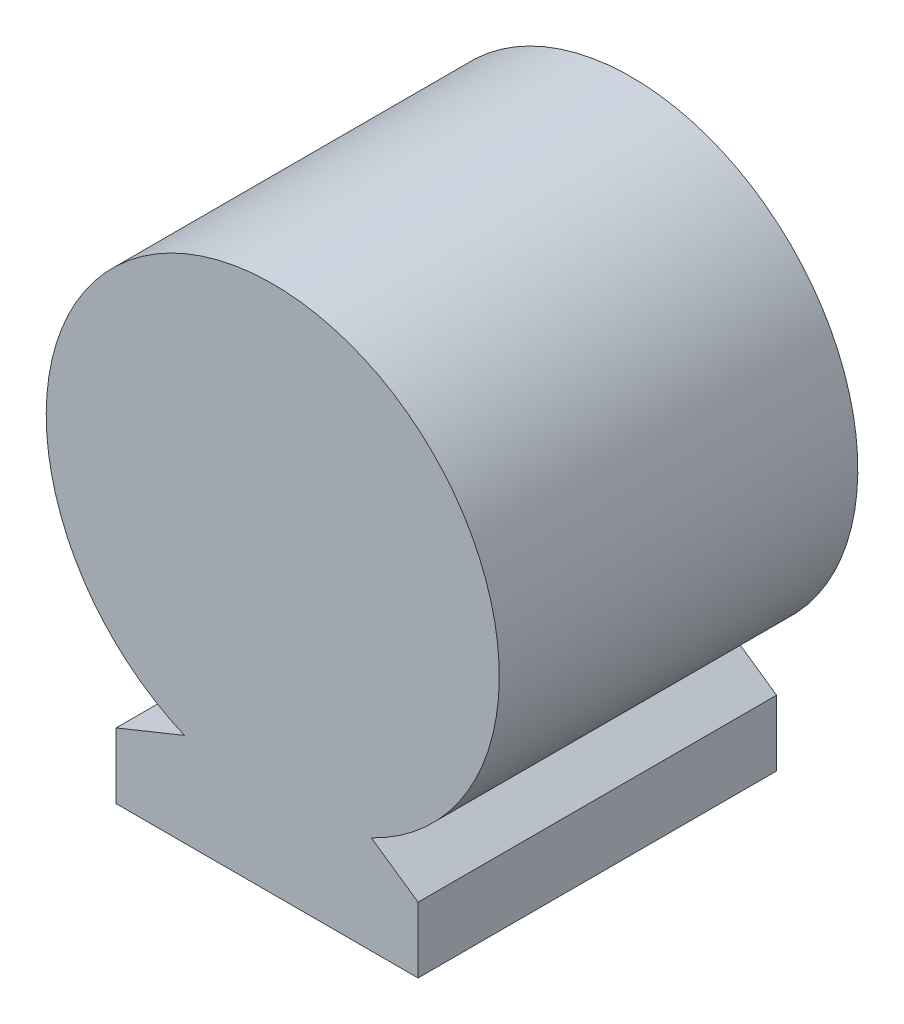
ISO-10303-21;
HEADER;
FILE_DESCRIPTION(('STEP AP214'),'2;1');
FILE_NAME('part.step','',(''),(''),'','','');
FILE_SCHEMA(('AUTOMOTIVE_DESIGN { 1 0 10303 214 1 1 1 1 }'));
ENDSEC;
DATA;
#1=APPLICATION_CONTEXT('core data for automotive mechanical design processes');
#2=APPLICATION_PROTOCOL_DEFINITION('international standard','automotive_design',2000,#1);
#3=PRODUCT_CONTEXT('',#1,'mechanical');
#4=PRODUCT('Part','Part','',(#3));
#5=PRODUCT_RELATED_PRODUCT_CATEGORY('part','',(#4));
#6=PRODUCT_DEFINITION_FORMATION('','',#4);
#7=PRODUCT_DEFINITION_CONTEXT('part definition',#1,'design');
#8=PRODUCT_DEFINITION('design','',#6,#7);
#9=PRODUCT_DEFINITION_SHAPE('','',#8);
#10=(LENGTH_UNIT() NAMED_UNIT(*) SI_UNIT(.MILLI.,.METRE.));
#11=(NAMED_UNIT(*) PLANE_ANGLE_UNIT() SI_UNIT($,.RADIAN.));
#12=(NAMED_UNIT(*) SI_UNIT($,.STERADIAN.) SOLID_ANGLE_UNIT());
#13=UNCERTAINTY_MEASURE_WITH_UNIT(LENGTH_MEASURE(1.E-05),#10,'distance_accuracy_value','');
#14=(GEOMETRIC_REPRESENTATION_CONTEXT(3) GLOBAL_UNCERTAINTY_ASSIGNED_CONTEXT((#13)) GLOBAL_UNIT_ASSIGNED_CONTEXT((#10,
#11,#12)) REPRESENTATION_CONTEXT('',''));
#15=CARTESIAN_POINT('',(0.,0.,0.));
#16=DIRECTION('',(0.,0.,1.));
#17=DIRECTION('',(1.,0.,0.));
#18=AXIS2_PLACEMENT_3D('',#15,#16,#17);
#19=CARTESIAN_POINT('',(-41.5,-80.,95.));
#20=DIRECTION('',(1.,0.,0.));
#21=DIRECTION('',(0.,0.,-1.));
#22=AXIS2_PLACEMENT_3D('',#19,#20,#21);
#23=PLANE('',#22);
#24=DIRECTION('',(0.,-1.,0.));
#25=VECTOR('',#24,1.);
#26=CARTESIAN_POINT('',(-41.5,-80.,0.));
#27=LINE('',#26,#25);
#28=CARTESIAN_POINT('',(-41.5,-62.6095468752527,0.));
#29=VERTEX_POINT('',#28);
#30=CARTESIAN_POINT('',(-41.5,-80.,0.));
#31=VERTEX_POINT('',#30);
#32=EDGE_CURVE('E116',#29,#31,#27,.T.);
#33=ORIENTED_EDGE('',*,*,#32,.T.);
#34=DIRECTION('',(0.,0.,-1.));
#35=VECTOR('',#34,1.);
#36=CARTESIAN_POINT('',(-41.5,-80.,95.));
#37=LINE('',#36,#35);
#38=CARTESIAN_POINT('',(-41.5,-80.,95.));
#39=VERTEX_POINT('',#38);
#40=EDGE_CURVE('E11',#39,#31,#37,.T.);
#41=ORIENTED_EDGE('',*,*,#40,.F.);
#42=DIRECTION('',(0.,-1.,0.));
#43=VECTOR('',#42,1.);
#44=CARTESIAN_POINT('',(-41.5,-80.,95.));
#45=LINE('',#44,#43);
#46=CARTESIAN_POINT('',(-41.5,-62.6095468752527,95.));
#47=VERTEX_POINT('',#46);
#48=EDGE_CURVE('E126',#47,#39,#45,.T.);
#49=ORIENTED_EDGE('',*,*,#48,.F.);
#50=DIRECTION('',(0.,0.,-1.));
#51=VECTOR('',#50,1.);
#52=CARTESIAN_POINT('',(-41.5,-62.6095468752527,95.));
#53=LINE('',#52,#51);
#54=EDGE_CURVE('E112',#47,#29,#53,.T.);
#55=ORIENTED_EDGE('',*,*,#54,.T.);
#56=EDGE_LOOP('',(#33,#41,#49,#55));
#57=FACE_BOUND('',#56,.T.);
#58=ADVANCED_FACE('F32',(#57),#23,.F.);
#59=CARTESIAN_POINT('',(-41.5,-80.,95.));
#60=DIRECTION('',(0.,1.,0.));
#61=DIRECTION('',(0.,0.,1.));
#62=AXIS2_PLACEMENT_3D('',#59,#60,#61);
#63=PLANE('',#62);
#64=DIRECTION('',(1.,0.,0.));
#65=VECTOR('',#64,1.);
#66=CARTESIAN_POINT('',(-41.5,-80.,0.));
#67=LINE('',#66,#65);
#68=CARTESIAN_POINT('',(38.5,-80.,0.));
#69=VERTEX_POINT('',#68);
#70=EDGE_CURVE('E119',#31,#69,#67,.T.);
#71=ORIENTED_EDGE('',*,*,#70,.T.);
#72=DIRECTION('',(0.,0.,-1.));
#73=VECTOR('',#72,1.);
#74=CARTESIAN_POINT('',(38.5,-80.,95.));
#75=LINE('',#74,#73);
#76=CARTESIAN_POINT('',(38.5,-80.,95.));
#77=VERTEX_POINT('',#76);
#78=EDGE_CURVE('E40',#77,#69,#75,.T.);
#79=ORIENTED_EDGE('',*,*,#78,.F.);
#80=DIRECTION('',(1.,0.,0.));
#81=VECTOR('',#80,1.);
#82=CARTESIAN_POINT('',(-41.5,-80.,95.));
#83=LINE('',#82,#81);
#84=EDGE_CURVE('E85',#39,#77,#83,.T.);
#85=ORIENTED_EDGE('',*,*,#84,.F.);
#86=ORIENTED_EDGE('',*,*,#40,.T.);
#87=EDGE_LOOP('',(#71,#79,#85,#86));
#88=FACE_BOUND('',#87,.T.);
#89=ADVANCED_FACE('F150',(#88),#63,.F.);
#90=CARTESIAN_POINT('',(38.5,-80.,95.));
#91=DIRECTION('',(-1.,0.,0.));
#92=DIRECTION('',(0.,0.,1.));
#93=AXIS2_PLACEMENT_3D('',#90,#91,#92);
#94=PLANE('',#93);
#95=DIRECTION('',(0.,1.,0.));
#96=VECTOR('',#95,1.);
#97=CARTESIAN_POINT('',(38.5,-80.,0.));
#98=LINE('',#97,#96);
#99=CARTESIAN_POINT('',(38.5,-62.6095468752527,0.));
#100=VERTEX_POINT('',#99);
#101=EDGE_CURVE('E121',#69,#100,#98,.T.);
#102=ORIENTED_EDGE('',*,*,#101,.T.);
#103=DIRECTION('',(0.,0.,-1.));
#104=VECTOR('',#103,1.);
#105=CARTESIAN_POINT('',(38.5,-62.6095468752527,95.));
#106=LINE('',#105,#104);
#107=CARTESIAN_POINT('',(38.5,-62.6095468752527,95.));
#108=VERTEX_POINT('',#107);
#109=EDGE_CURVE('E107',#108,#100,#106,.T.);
#110=ORIENTED_EDGE('',*,*,#109,.F.);
#111=DIRECTION('',(0.,1.,0.));
#112=VECTOR('',#111,1.);
#113=CARTESIAN_POINT('',(38.5,-80.,95.));
#114=LINE('',#113,#112);
#115=EDGE_CURVE('E98',#77,#108,#114,.T.);
#116=ORIENTED_EDGE('',*,*,#115,.F.);
#117=ORIENTED_EDGE('',*,*,#78,.T.);
#118=EDGE_LOOP('',(#102,#110,#116,#117));
#119=FACE_BOUND('',#118,.T.);
#120=ADVANCED_FACE('F132',(#119),#94,.F.);
#121=CARTESIAN_POINT('',(38.5,-62.6095468752527,95.));
#122=DIRECTION('',(-0.569339220557101,-0.8221027015741,0.));
#123=DIRECTION('',(0.8221027015741,-0.569339220557101,0.));
#124=AXIS2_PLACEMENT_3D('',#121,#122,#123);
#125=PLANE('',#124);
#126=DIRECTION('',(-0.8221027015741,0.569339220557101,0.));
#127=VECTOR('',#126,1.);
#128=CARTESIAN_POINT('',(38.5,-62.6095468752527,0.));
#129=LINE('',#128,#127);
#130=CARTESIAN_POINT('',(26.120922851889,-54.0365375404981,0.));
#131=VERTEX_POINT('',#130);
#132=EDGE_CURVE('E106',#100,#131,#129,.T.);
#133=ORIENTED_EDGE('',*,*,#132,.T.);
#134=DIRECTION('',(0.,0.,-1.));
#135=VECTOR('',#134,1.);
#136=CARTESIAN_POINT('',(26.120922851889,-54.0365375404981,95.));
#137=LINE('',#136,#135);
#138=CARTESIAN_POINT('',(26.120922851889,-54.0365375404981,95.));
#139=VERTEX_POINT('',#138);
#140=EDGE_CURVE('E103',#139,#131,#137,.T.);
#141=ORIENTED_EDGE('',*,*,#140,.F.);
#142=DIRECTION('',(-0.8221027015741,0.569339220557101,0.));
#143=VECTOR('',#142,1.);
#144=CARTESIAN_POINT('',(38.5,-62.6095468752527,95.));
#145=LINE('',#144,#143);
#146=EDGE_CURVE('E92',#108,#139,#145,.T.);
#147=ORIENTED_EDGE('',*,*,#146,.F.);
#148=ORIENTED_EDGE('',*,*,#109,.T.);
#149=EDGE_LOOP('',(#133,#141,#147,#148));
#150=FACE_BOUND('',#149,.T.);
#151=ADVANCED_FACE('F104',(#150),#125,.F.);
#152=CARTESIAN_POINT('',(0.,0.,95.));
#153=DIRECTION('',(0.,0.,-1.));
#154=DIRECTION('',(-1.,0.,0.));
#155=AXIS2_PLACEMENT_3D('',#152,#153,#154);
#156=CYLINDRICAL_SURFACE('',#155,60.0187470712277);
#157=CARTESIAN_POINT('',(0.,0.,0.));
#158=DIRECTION('',(0.,0.,1.));
#159=DIRECTION('',(1.,0.,0.));
#160=AXIS2_PLACEMENT_3D('',#157,#158,#159);
#161=CIRCLE('',#160,60.0187470712277);
#162=CARTESIAN_POINT('',(-23.3881528025802,-55.2742644318598,0.));
#163=VERTEX_POINT('',#162);
#164=EDGE_CURVE('E71',#131,#163,#161,.T.);
#165=ORIENTED_EDGE('',*,*,#164,.T.);
#166=DIRECTION('',(0.,0.,-1.));
#167=VECTOR('',#166,1.);
#168=CARTESIAN_POINT('',(-23.3881528025802,-55.2742644318598,95.));
#169=LINE('',#168,#167);
#170=CARTESIAN_POINT('',(-23.3881528025802,-55.2742644318598,95.));
#171=VERTEX_POINT('',#170);
#172=EDGE_CURVE('E108',#171,#163,#169,.T.);
#173=ORIENTED_EDGE('',*,*,#172,.F.);
#174=CARTESIAN_POINT('',(0.,0.,95.));
#175=DIRECTION('',(0.,0.,1.));
#176=DIRECTION('',(1.,0.,0.));
#177=AXIS2_PLACEMENT_3D('',#174,#175,#176);
#178=CIRCLE('',#177,60.0187470712277);
#179=EDGE_CURVE('E96',#139,#171,#178,.T.);
#180=ORIENTED_EDGE('',*,*,#179,.F.);
#181=ORIENTED_EDGE('',*,*,#140,.T.);
#182=EDGE_LOOP('',(#165,#173,#180,#181));
#183=FACE_BOUND('',#182,.T.);
#184=ADVANCED_FACE('F110',(#183),#156,.T.);
#185=CARTESIAN_POINT('',(-41.5,-62.6095468752527,95.));
#186=DIRECTION('',(0.375381678740172,-0.926870322788582,0.));
#187=DIRECTION('',(0.926870322788582,0.375381678740173,0.));
#188=AXIS2_PLACEMENT_3D('',#185,#186,#187);
#189=PLANE('',#188);
#190=DIRECTION('',(-0.926870322788582,-0.375381678740172,0.));
#191=VECTOR('',#190,1.);
#192=CARTESIAN_POINT('',(-41.5,-62.6095468752527,0.));
#193=LINE('',#192,#191);
#194=EDGE_CURVE('E77',#163,#29,#193,.T.);
#195=ORIENTED_EDGE('',*,*,#194,.T.);
#196=ORIENTED_EDGE('',*,*,#54,.F.);
#197=DIRECTION('',(-0.926870322788582,-0.375381678740172,0.));
#198=VECTOR('',#197,1.);
#199=CARTESIAN_POINT('',(-41.5,-62.6095468752527,95.));
#200=LINE('',#199,#198);
#201=EDGE_CURVE('E48',#171,#47,#200,.T.);
#202=ORIENTED_EDGE('',*,*,#201,.F.);
#203=ORIENTED_EDGE('',*,*,#172,.T.);
#204=EDGE_LOOP('',(#195,#196,#202,#203));
#205=FACE_BOUND('',#204,.T.);
#206=ADVANCED_FACE('F139',(#205),#189,.F.);
#207=CARTESIAN_POINT('',(0.,0.,95.));
#208=DIRECTION('',(0.,0.,1.));
#209=DIRECTION('',(1.,0.,0.));
#210=AXIS2_PLACEMENT_3D('',#207,#208,#209);
#211=PLANE('',#210);
#212=ORIENTED_EDGE('',*,*,#48,.T.);
#213=ORIENTED_EDGE('',*,*,#84,.T.);
#214=ORIENTED_EDGE('',*,*,#115,.T.);
#215=ORIENTED_EDGE('',*,*,#146,.T.);
#216=ORIENTED_EDGE('',*,*,#179,.T.);
#217=ORIENTED_EDGE('',*,*,#201,.T.);
#218=EDGE_LOOP('',(#212,#213,#214,#215,#216,#217));
#219=FACE_BOUND('',#218,.T.);
#220=ADVANCED_FACE('F94',(#219),#211,.T.);
#221=CARTESIAN_POINT('',(0.,0.,0.));
#222=DIRECTION('',(0.,0.,1.));
#223=DIRECTION('',(1.,0.,0.));
#224=AXIS2_PLACEMENT_3D('',#221,#222,#223);
#225=PLANE('',#224);
#226=ORIENTED_EDGE('',*,*,#32,.F.);
#227=ORIENTED_EDGE('',*,*,#194,.F.);
#228=ORIENTED_EDGE('',*,*,#164,.F.);
#229=ORIENTED_EDGE('',*,*,#132,.F.);
#230=ORIENTED_EDGE('',*,*,#101,.F.);
#231=ORIENTED_EDGE('',*,*,#70,.F.);
#232=EDGE_LOOP('',(#226,#227,#228,#229,#230,#231));
#233=FACE_BOUND('',#232,.T.);
#234=ADVANCED_FACE('F135',(#233),#225,.F.);
#235=CLOSED_SHELL('',(#58,#89,#120,#151,#184,#206,#220,#234));
#236=MANIFOLD_SOLID_BREP('B2',#235);
#237=ADVANCED_BREP_SHAPE_REPRESENTATION('',(#18,#236),#14);
#238=SHAPE_DEFINITION_REPRESENTATION(#9,#237);
ENDSEC;
END-ISO-10303-21;
